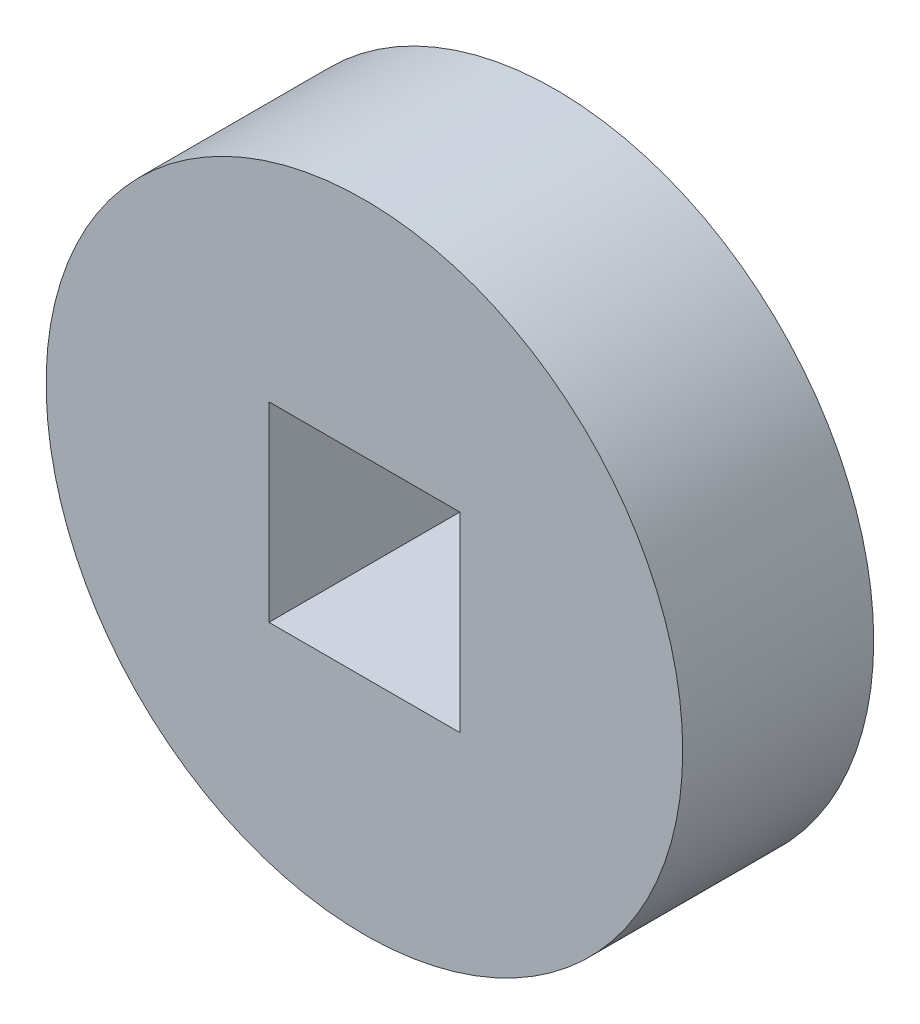
ISO-10303-21;
HEADER;
FILE_DESCRIPTION(('STEP AP214'),'2;1');
FILE_NAME('part.step','',(''),(''),'','','');
FILE_SCHEMA(('AUTOMOTIVE_DESIGN { 1 0 10303 214 1 1 1 1 }'));
ENDSEC;
DATA;
#1=APPLICATION_CONTEXT('core data for automotive mechanical design processes');
#2=APPLICATION_PROTOCOL_DEFINITION('international standard','automotive_design',2000,#1);
#3=PRODUCT_CONTEXT('',#1,'mechanical');
#4=PRODUCT('Part','Part','',(#3));
#5=PRODUCT_RELATED_PRODUCT_CATEGORY('part','',(#4));
#6=PRODUCT_DEFINITION_FORMATION('','',#4);
#7=PRODUCT_DEFINITION_CONTEXT('part definition',#1,'design');
#8=PRODUCT_DEFINITION('design','',#6,#7);
#9=PRODUCT_DEFINITION_SHAPE('','',#8);
#10=(LENGTH_UNIT() NAMED_UNIT(*) SI_UNIT(.MILLI.,.METRE.));
#11=(NAMED_UNIT(*) PLANE_ANGLE_UNIT() SI_UNIT($,.RADIAN.));
#12=(NAMED_UNIT(*) SI_UNIT($,.STERADIAN.) SOLID_ANGLE_UNIT());
#13=UNCERTAINTY_MEASURE_WITH_UNIT(LENGTH_MEASURE(1.E-05),#10,'distance_accuracy_value','');
#14=(GEOMETRIC_REPRESENTATION_CONTEXT(3) GLOBAL_UNCERTAINTY_ASSIGNED_CONTEXT((#13)) GLOBAL_UNIT_ASSIGNED_CONTEXT((#10,
#11,#12)) REPRESENTATION_CONTEXT('',''));
#15=CARTESIAN_POINT('',(0.,0.,0.));
#16=DIRECTION('',(0.,0.,1.));
#17=DIRECTION('',(1.,0.,0.));
#18=AXIS2_PLACEMENT_3D('',#15,#16,#17);
#19=CARTESIAN_POINT('',(0.,0.,3.));
#20=DIRECTION('',(0.,0.,1.));
#21=DIRECTION('',(1.,0.,0.));
#22=AXIS2_PLACEMENT_3D('',#19,#20,#21);
#23=PLANE('',#22);
#24=CARTESIAN_POINT('',(0.,0.,3.));
#25=DIRECTION('',(0.,0.,1.));
#26=DIRECTION('',(1.,0.,0.));
#27=AXIS2_PLACEMENT_3D('',#24,#25,#26);
#28=CIRCLE('',#27,5.);
#29=CARTESIAN_POINT('',(5.,0.,3.));
#30=VERTEX_POINT('',#29);
#31=EDGE_CURVE('E11',#30,#30,#28,.T.);
#32=ORIENTED_EDGE('',*,*,#31,.T.);
#33=EDGE_LOOP('',(#32));
#34=FACE_BOUND('',#33,.T.);
#35=DIRECTION('',(1.,0.,0.));
#36=VECTOR('',#35,1.);
#37=CARTESIAN_POINT('',(-1.5,-1.5,3.));
#38=LINE('',#37,#36);
#39=CARTESIAN_POINT('',(-1.5,-1.5,3.));
#40=VERTEX_POINT('',#39);
#41=CARTESIAN_POINT('',(1.5,-1.5,3.));
#42=VERTEX_POINT('',#41);
#43=EDGE_CURVE('E81',#40,#42,#38,.T.);
#44=ORIENTED_EDGE('',*,*,#43,.F.);
#45=DIRECTION('',(0.,-1.,0.));
#46=VECTOR('',#45,1.);
#47=CARTESIAN_POINT('',(-1.5,1.5,3.));
#48=LINE('',#47,#46);
#49=CARTESIAN_POINT('',(-1.5,1.5,3.));
#50=VERTEX_POINT('',#49);
#51=EDGE_CURVE('E73',#50,#40,#48,.T.);
#52=ORIENTED_EDGE('',*,*,#51,.F.);
#53=DIRECTION('',(-1.,0.,0.));
#54=VECTOR('',#53,1.);
#55=CARTESIAN_POINT('',(-1.5,1.5,3.));
#56=LINE('',#55,#54);
#57=CARTESIAN_POINT('',(1.5,1.5,3.));
#58=VERTEX_POINT('',#57);
#59=EDGE_CURVE('E94',#58,#50,#56,.T.);
#60=ORIENTED_EDGE('',*,*,#59,.F.);
#61=DIRECTION('',(0.,1.,0.));
#62=VECTOR('',#61,1.);
#63=CARTESIAN_POINT('',(1.5,1.5,3.));
#64=LINE('',#63,#62);
#65=EDGE_CURVE('E92',#42,#58,#64,.T.);
#66=ORIENTED_EDGE('',*,*,#65,.F.);
#67=EDGE_LOOP('',(#44,#52,#60,#66));
#68=FACE_BOUND('',#67,.T.);
#69=ADVANCED_FACE('F32',(#34,#68),#23,.T.);
#70=CARTESIAN_POINT('',(0.,0.,0.));
#71=DIRECTION('',(0.,0.,1.));
#72=DIRECTION('',(1.,0.,0.));
#73=AXIS2_PLACEMENT_3D('',#70,#71,#72);
#74=PLANE('',#73);
#75=CARTESIAN_POINT('',(0.,0.,0.));
#76=DIRECTION('',(0.,0.,1.));
#77=DIRECTION('',(1.,0.,0.));
#78=AXIS2_PLACEMENT_3D('',#75,#76,#77);
#79=CIRCLE('',#78,5.);
#80=CARTESIAN_POINT('',(5.,0.,0.));
#81=VERTEX_POINT('',#80);
#82=EDGE_CURVE('E36',#81,#81,#79,.T.);
#83=ORIENTED_EDGE('',*,*,#82,.F.);
#84=EDGE_LOOP('',(#83));
#85=FACE_BOUND('',#84,.T.);
#86=DIRECTION('',(0.,-1.,0.));
#87=VECTOR('',#86,1.);
#88=CARTESIAN_POINT('',(-1.5,1.5,0.));
#89=LINE('',#88,#87);
#90=CARTESIAN_POINT('',(-1.5,1.5,0.));
#91=VERTEX_POINT('',#90);
#92=CARTESIAN_POINT('',(-1.5,-1.5,0.));
#93=VERTEX_POINT('',#92);
#94=EDGE_CURVE('E55',#91,#93,#89,.T.);
#95=ORIENTED_EDGE('',*,*,#94,.T.);
#96=DIRECTION('',(1.,0.,0.));
#97=VECTOR('',#96,1.);
#98=CARTESIAN_POINT('',(-1.5,-1.5,0.));
#99=LINE('',#98,#97);
#100=CARTESIAN_POINT('',(1.5,-1.5,0.));
#101=VERTEX_POINT('',#100);
#102=EDGE_CURVE('E88',#93,#101,#99,.T.);
#103=ORIENTED_EDGE('',*,*,#102,.T.);
#104=DIRECTION('',(0.,1.,0.));
#105=VECTOR('',#104,1.);
#106=CARTESIAN_POINT('',(1.5,1.5,0.));
#107=LINE('',#106,#105);
#108=CARTESIAN_POINT('',(1.5,1.5,0.));
#109=VERTEX_POINT('',#108);
#110=EDGE_CURVE('E100',#101,#109,#107,.T.);
#111=ORIENTED_EDGE('',*,*,#110,.T.);
#112=DIRECTION('',(-1.,0.,0.));
#113=VECTOR('',#112,1.);
#114=CARTESIAN_POINT('',(-1.5,1.5,0.));
#115=LINE('',#114,#113);
#116=EDGE_CURVE('E82',#109,#91,#115,.T.);
#117=ORIENTED_EDGE('',*,*,#116,.T.);
#118=EDGE_LOOP('',(#95,#103,#111,#117));
#119=FACE_BOUND('',#118,.T.);
#120=ADVANCED_FACE('F111',(#85,#119),#74,.F.);
#121=CARTESIAN_POINT('',(0.,0.,3.));
#122=DIRECTION('',(0.,0.,-1.));
#123=DIRECTION('',(-1.,0.,0.));
#124=AXIS2_PLACEMENT_3D('',#121,#122,#123);
#125=CYLINDRICAL_SURFACE('',#124,5.);
#126=ORIENTED_EDGE('',*,*,#31,.F.);
#127=EDGE_LOOP('',(#126));
#128=FACE_BOUND('',#127,.T.);
#129=ORIENTED_EDGE('',*,*,#82,.T.);
#130=EDGE_LOOP('',(#129));
#131=FACE_BOUND('',#130,.T.);
#132=ADVANCED_FACE('F34',(#128,#131),#125,.T.);
#133=CARTESIAN_POINT('',(-1.5,1.5,3.));
#134=DIRECTION('',(1.,0.,0.));
#135=DIRECTION('',(0.,1.,0.));
#136=AXIS2_PLACEMENT_3D('',#133,#134,#135);
#137=PLANE('',#136);
#138=ORIENTED_EDGE('',*,*,#94,.F.);
#139=DIRECTION('',(0.,0.,-1.));
#140=VECTOR('',#139,1.);
#141=CARTESIAN_POINT('',(-1.5,1.5,3.));
#142=LINE('',#141,#140);
#143=EDGE_CURVE('E77',#50,#91,#142,.T.);
#144=ORIENTED_EDGE('',*,*,#143,.F.);
#145=ORIENTED_EDGE('',*,*,#51,.T.);
#146=DIRECTION('',(0.,0.,-1.));
#147=VECTOR('',#146,1.);
#148=CARTESIAN_POINT('',(-1.5,-1.5,3.));
#149=LINE('',#148,#147);
#150=EDGE_CURVE('E76',#40,#93,#149,.T.);
#151=ORIENTED_EDGE('',*,*,#150,.T.);
#152=EDGE_LOOP('',(#138,#144,#145,#151));
#153=FACE_BOUND('',#152,.T.);
#154=ADVANCED_FACE('F75',(#153),#137,.T.);
#155=CARTESIAN_POINT('',(-1.5,-1.5,3.));
#156=DIRECTION('',(0.,1.,0.));
#157=DIRECTION('',(0.,0.,1.));
#158=AXIS2_PLACEMENT_3D('',#155,#156,#157);
#159=PLANE('',#158);
#160=ORIENTED_EDGE('',*,*,#102,.F.);
#161=ORIENTED_EDGE('',*,*,#150,.F.);
#162=ORIENTED_EDGE('',*,*,#43,.T.);
#163=DIRECTION('',(0.,0.,-1.));
#164=VECTOR('',#163,1.);
#165=CARTESIAN_POINT('',(1.5,-1.5,3.));
#166=LINE('',#165,#164);
#167=EDGE_CURVE('E89',#42,#101,#166,.T.);
#168=ORIENTED_EDGE('',*,*,#167,.T.);
#169=EDGE_LOOP('',(#160,#161,#162,#168));
#170=FACE_BOUND('',#169,.T.);
#171=ADVANCED_FACE('F85',(#170),#159,.T.);
#172=CARTESIAN_POINT('',(1.5,1.5,3.));
#173=DIRECTION('',(-1.,0.,0.));
#174=DIRECTION('',(0.,-1.,0.));
#175=AXIS2_PLACEMENT_3D('',#172,#173,#174);
#176=PLANE('',#175);
#177=ORIENTED_EDGE('',*,*,#110,.F.);
#178=ORIENTED_EDGE('',*,*,#167,.F.);
#179=ORIENTED_EDGE('',*,*,#65,.T.);
#180=DIRECTION('',(0.,0.,-1.));
#181=VECTOR('',#180,1.);
#182=CARTESIAN_POINT('',(1.5,1.5,3.));
#183=LINE('',#182,#181);
#184=EDGE_CURVE('E47',#58,#109,#183,.T.);
#185=ORIENTED_EDGE('',*,*,#184,.T.);
#186=EDGE_LOOP('',(#177,#178,#179,#185));
#187=FACE_BOUND('',#186,.T.);
#188=ADVANCED_FACE('F109',(#187),#176,.T.);
#189=CARTESIAN_POINT('',(-1.5,1.5,3.));
#190=DIRECTION('',(0.,-1.,0.));
#191=DIRECTION('',(1.,0.,0.));
#192=AXIS2_PLACEMENT_3D('',#189,#190,#191);
#193=PLANE('',#192);
#194=ORIENTED_EDGE('',*,*,#116,.F.);
#195=ORIENTED_EDGE('',*,*,#184,.F.);
#196=ORIENTED_EDGE('',*,*,#59,.T.);
#197=ORIENTED_EDGE('',*,*,#143,.T.);
#198=EDGE_LOOP('',(#194,#195,#196,#197));
#199=FACE_BOUND('',#198,.T.);
#200=ADVANCED_FACE('F112',(#199),#193,.T.);
#201=CLOSED_SHELL('',(#69,#120,#132,#154,#171,#188,#200));
#202=MANIFOLD_SOLID_BREP('B2',#201);
#203=ADVANCED_BREP_SHAPE_REPRESENTATION('',(#18,#202),#14);
#204=SHAPE_DEFINITION_REPRESENTATION(#9,#203);
ENDSEC;
END-ISO-10303-21;
